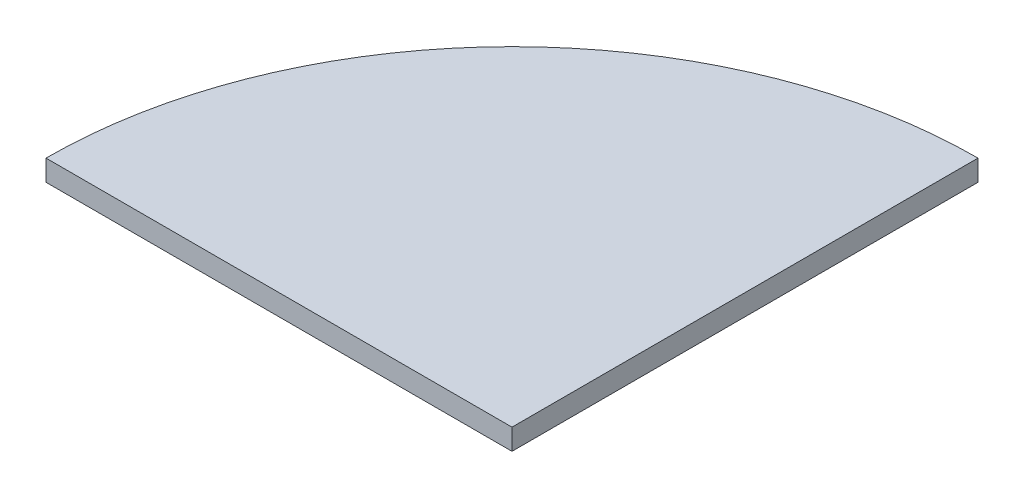
ISO-10303-21;
HEADER;
FILE_DESCRIPTION(('STEP AP214'),'2;1');
FILE_NAME('part.step','',(''),(''),'','','');
FILE_SCHEMA(('AUTOMOTIVE_DESIGN { 1 0 10303 214 1 1 1 1 }'));
ENDSEC;
DATA;
#1=APPLICATION_CONTEXT('core data for automotive mechanical design processes');
#2=APPLICATION_PROTOCOL_DEFINITION('international standard','automotive_design',2000,#1);
#3=PRODUCT_CONTEXT('',#1,'mechanical');
#4=PRODUCT('Part','Part','',(#3));
#5=PRODUCT_RELATED_PRODUCT_CATEGORY('part','',(#4));
#6=PRODUCT_DEFINITION_FORMATION('','',#4);
#7=PRODUCT_DEFINITION_CONTEXT('part definition',#1,'design');
#8=PRODUCT_DEFINITION('design','',#6,#7);
#9=PRODUCT_DEFINITION_SHAPE('','',#8);
#10=(LENGTH_UNIT() NAMED_UNIT(*) SI_UNIT(.MILLI.,.METRE.));
#11=(NAMED_UNIT(*) PLANE_ANGLE_UNIT() SI_UNIT($,.RADIAN.));
#12=(NAMED_UNIT(*) SI_UNIT($,.STERADIAN.) SOLID_ANGLE_UNIT());
#13=UNCERTAINTY_MEASURE_WITH_UNIT(LENGTH_MEASURE(1.E-05),#10,'distance_accuracy_value','');
#14=(GEOMETRIC_REPRESENTATION_CONTEXT(3) GLOBAL_UNCERTAINTY_ASSIGNED_CONTEXT((#13)) GLOBAL_UNIT_ASSIGNED_CONTEXT((#10,
#11,#12)) REPRESENTATION_CONTEXT('',''));
#15=CARTESIAN_POINT('',(0.,0.,0.));
#16=DIRECTION('',(0.,0.,1.));
#17=DIRECTION('',(1.,0.,0.));
#18=AXIS2_PLACEMENT_3D('',#15,#16,#17);
#19=CARTESIAN_POINT('',(0.,18.,0.));
#20=DIRECTION('',(-1.,0.,0.));
#21=DIRECTION('',(0.,0.,1.));
#22=AXIS2_PLACEMENT_3D('',#19,#20,#21);
#23=PLANE('',#22);
#24=DIRECTION('',(0.,0.,-1.));
#25=VECTOR('',#24,1.);
#26=CARTESIAN_POINT('',(0.,0.,0.));
#27=LINE('',#26,#25);
#28=CARTESIAN_POINT('',(0.,0.,0.));
#29=VERTEX_POINT('',#28);
#30=CARTESIAN_POINT('',(0.,0.,-400.));
#31=VERTEX_POINT('',#30);
#32=EDGE_CURVE('E82',#29,#31,#27,.T.);
#33=ORIENTED_EDGE('',*,*,#32,.T.);
#34=DIRECTION('',(0.,-1.,0.));
#35=VECTOR('',#34,1.);
#36=CARTESIAN_POINT('',(0.,18.,-400.));
#37=LINE('',#36,#35);
#38=CARTESIAN_POINT('',(0.,18.,-400.));
#39=VERTEX_POINT('',#38);
#40=EDGE_CURVE('E11',#39,#31,#37,.T.);
#41=ORIENTED_EDGE('',*,*,#40,.F.);
#42=DIRECTION('',(0.,0.,-1.));
#43=VECTOR('',#42,1.);
#44=CARTESIAN_POINT('',(0.,18.,0.));
#45=LINE('',#44,#43);
#46=CARTESIAN_POINT('',(0.,18.,0.));
#47=VERTEX_POINT('',#46);
#48=EDGE_CURVE('E75',#47,#39,#45,.T.);
#49=ORIENTED_EDGE('',*,*,#48,.F.);
#50=DIRECTION('',(0.,-1.,0.));
#51=VECTOR('',#50,1.);
#52=CARTESIAN_POINT('',(0.,18.,0.));
#53=LINE('',#52,#51);
#54=EDGE_CURVE('E83',#47,#29,#53,.T.);
#55=ORIENTED_EDGE('',*,*,#54,.T.);
#56=EDGE_LOOP('',(#33,#41,#49,#55));
#57=FACE_BOUND('',#56,.T.);
#58=ADVANCED_FACE('F35',(#57),#23,.F.);
#59=CARTESIAN_POINT('',(0.,18.,0.));
#60=DIRECTION('',(0.,-1.,0.));
#61=DIRECTION('',(0.,0.,-1.));
#62=AXIS2_PLACEMENT_3D('',#59,#60,#61);
#63=CYLINDRICAL_SURFACE('',#62,400.);
#64=CARTESIAN_POINT('',(0.,0.,0.));
#65=DIRECTION('',(0.,1.,0.));
#66=DIRECTION('',(0.,0.,-1.));
#67=AXIS2_PLACEMENT_3D('',#64,#65,#66);
#68=CIRCLE('',#67,400.);
#69=CARTESIAN_POINT('',(-400.,0.,0.));
#70=VERTEX_POINT('',#69);
#71=EDGE_CURVE('E63',#31,#70,#68,.T.);
#72=ORIENTED_EDGE('',*,*,#71,.T.);
#73=DIRECTION('',(0.,-1.,0.));
#74=VECTOR('',#73,1.);
#75=CARTESIAN_POINT('',(-400.,18.,0.));
#76=LINE('',#75,#74);
#77=CARTESIAN_POINT('',(-400.,18.,0.));
#78=VERTEX_POINT('',#77);
#79=EDGE_CURVE('E43',#78,#70,#76,.T.);
#80=ORIENTED_EDGE('',*,*,#79,.F.);
#81=CARTESIAN_POINT('',(0.,18.,0.));
#82=DIRECTION('',(0.,1.,0.));
#83=DIRECTION('',(0.,0.,-1.));
#84=AXIS2_PLACEMENT_3D('',#81,#82,#83);
#85=CIRCLE('',#84,400.);
#86=EDGE_CURVE('E71',#39,#78,#85,.T.);
#87=ORIENTED_EDGE('',*,*,#86,.F.);
#88=ORIENTED_EDGE('',*,*,#40,.T.);
#89=EDGE_LOOP('',(#72,#80,#87,#88));
#90=FACE_BOUND('',#89,.T.);
#91=ADVANCED_FACE('F72',(#90),#63,.T.);
#92=CARTESIAN_POINT('',(-400.,18.,0.));
#93=DIRECTION('',(0.,0.,-1.));
#94=DIRECTION('',(-1.,0.,0.));
#95=AXIS2_PLACEMENT_3D('',#92,#93,#94);
#96=PLANE('',#95);
#97=DIRECTION('',(1.,0.,0.));
#98=VECTOR('',#97,1.);
#99=CARTESIAN_POINT('',(-400.,0.,0.));
#100=LINE('',#99,#98);
#101=EDGE_CURVE('E68',#70,#29,#100,.T.);
#102=ORIENTED_EDGE('',*,*,#101,.T.);
#103=ORIENTED_EDGE('',*,*,#54,.F.);
#104=DIRECTION('',(1.,0.,0.));
#105=VECTOR('',#104,1.);
#106=CARTESIAN_POINT('',(-400.,18.,0.));
#107=LINE('',#106,#105);
#108=EDGE_CURVE('E51',#78,#47,#107,.T.);
#109=ORIENTED_EDGE('',*,*,#108,.F.);
#110=ORIENTED_EDGE('',*,*,#79,.T.);
#111=EDGE_LOOP('',(#102,#103,#109,#110));
#112=FACE_BOUND('',#111,.T.);
#113=ADVANCED_FACE('F90',(#112),#96,.F.);
#114=CARTESIAN_POINT('',(0.,18.,0.));
#115=DIRECTION('',(0.,-1.,0.));
#116=DIRECTION('',(0.,0.,-1.));
#117=AXIS2_PLACEMENT_3D('',#114,#115,#116);
#118=PLANE('',#117);
#119=ORIENTED_EDGE('',*,*,#48,.T.);
#120=ORIENTED_EDGE('',*,*,#86,.T.);
#121=ORIENTED_EDGE('',*,*,#108,.T.);
#122=EDGE_LOOP('',(#119,#120,#121));
#123=FACE_BOUND('',#122,.T.);
#124=ADVANCED_FACE('F78',(#123),#118,.F.);
#125=CARTESIAN_POINT('',(0.,0.,0.));
#126=DIRECTION('',(0.,-1.,0.));
#127=DIRECTION('',(0.,0.,-1.));
#128=AXIS2_PLACEMENT_3D('',#125,#126,#127);
#129=PLANE('',#128);
#130=ORIENTED_EDGE('',*,*,#32,.F.);
#131=ORIENTED_EDGE('',*,*,#101,.F.);
#132=ORIENTED_EDGE('',*,*,#71,.F.);
#133=EDGE_LOOP('',(#130,#131,#132));
#134=FACE_BOUND('',#133,.T.);
#135=ADVANCED_FACE('F91',(#134),#129,.T.);
#136=CLOSED_SHELL('',(#58,#91,#113,#124,#135));
#137=MANIFOLD_SOLID_BREP('B2',#136);
#138=ADVANCED_BREP_SHAPE_REPRESENTATION('',(#18,#137),#14);
#139=SHAPE_DEFINITION_REPRESENTATION(#9,#138);
ENDSEC;
END-ISO-10303-21;
